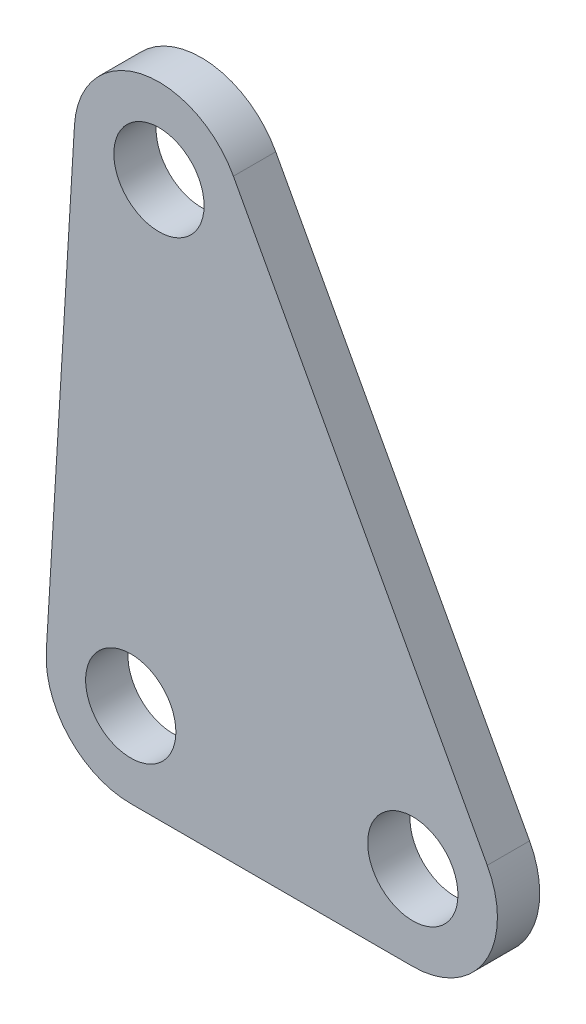
ISO-10303-21;
HEADER;
FILE_DESCRIPTION(('STEP AP214'),'2;1');
FILE_NAME('part.step','',(''),(''),'','','');
FILE_SCHEMA(('AUTOMOTIVE_DESIGN { 1 0 10303 214 1 1 1 1 }'));
ENDSEC;
DATA;
#1=APPLICATION_CONTEXT('core data for automotive mechanical design processes');
#2=APPLICATION_PROTOCOL_DEFINITION('international standard','automotive_design',2000,#1);
#3=PRODUCT_CONTEXT('',#1,'mechanical');
#4=PRODUCT('Part','Part','',(#3));
#5=PRODUCT_RELATED_PRODUCT_CATEGORY('part','',(#4));
#6=PRODUCT_DEFINITION_FORMATION('','',#4);
#7=PRODUCT_DEFINITION_CONTEXT('part definition',#1,'design');
#8=PRODUCT_DEFINITION('design','',#6,#7);
#9=PRODUCT_DEFINITION_SHAPE('','',#8);
#10=(LENGTH_UNIT() NAMED_UNIT(*) SI_UNIT(.MILLI.,.METRE.));
#11=(NAMED_UNIT(*) PLANE_ANGLE_UNIT() SI_UNIT($,.RADIAN.));
#12=(NAMED_UNIT(*) SI_UNIT($,.STERADIAN.) SOLID_ANGLE_UNIT());
#13=UNCERTAINTY_MEASURE_WITH_UNIT(LENGTH_MEASURE(1.E-05),#10,'distance_accuracy_value','');
#14=(GEOMETRIC_REPRESENTATION_CONTEXT(3) GLOBAL_UNCERTAINTY_ASSIGNED_CONTEXT((#13)) GLOBAL_UNIT_ASSIGNED_CONTEXT((#10,
#11,#12)) REPRESENTATION_CONTEXT('',''));
#15=CARTESIAN_POINT('',(0.,0.,0.));
#16=DIRECTION('',(0.,0.,1.));
#17=DIRECTION('',(1.,0.,0.));
#18=AXIS2_PLACEMENT_3D('',#15,#16,#17);
#19=CARTESIAN_POINT('',(-1.,-16.6578196635567,1.5));
#20=DIRECTION('',(0.,0.,1.));
#21=DIRECTION('',(1.,0.,0.));
#22=AXIS2_PLACEMENT_3D('',#19,#20,#21);
#23=PLANE('',#22);
#24=CARTESIAN_POINT('',(9.,-16.6578196635567,1.5));
#25=DIRECTION('',(0.,0.,1.));
#26=DIRECTION('',(1.,0.,0.));
#27=AXIS2_PLACEMENT_3D('',#24,#25,#26);
#28=CIRCLE('',#27,1.6);
#29=CARTESIAN_POINT('',(10.6,-16.6578196635567,1.5));
#30=VERTEX_POINT('',#29);
#31=EDGE_CURVE('E184',#30,#30,#28,.T.);
#32=ORIENTED_EDGE('',*,*,#31,.F.);
#33=EDGE_LOOP('',(#32));
#34=FACE_BOUND('',#33,.T.);
#35=CARTESIAN_POINT('',(-1.,-16.6578196635567,1.5));
#36=DIRECTION('',(0.,0.,1.));
#37=DIRECTION('',(1.,0.,0.));
#38=AXIS2_PLACEMENT_3D('',#35,#36,#37);
#39=CIRCLE('',#38,3.);
#40=CARTESIAN_POINT('',(-3.99460882983099,-16.4780477071834,1.5));
#41=VERTEX_POINT('',#40);
#42=CARTESIAN_POINT('',(-1.,-19.6578196635567,1.5));
#43=VERTEX_POINT('',#42);
#44=EDGE_CURVE('E129',#41,#43,#39,.T.);
#45=ORIENTED_EDGE('',*,*,#44,.T.);
#46=DIRECTION('',(1.,0.,0.));
#47=VECTOR('',#46,1.);
#48=CARTESIAN_POINT('',(-1.,-19.6578196635567,1.5));
#49=LINE('',#48,#47);
#50=CARTESIAN_POINT('',(9.,-19.6578196635567,1.5));
#51=VERTEX_POINT('',#50);
#52=EDGE_CURVE('E87',#43,#51,#49,.T.);
#53=ORIENTED_EDGE('',*,*,#52,.T.);
#54=CARTESIAN_POINT('',(9.,-16.6578196635567,1.5));
#55=DIRECTION('',(0.,0.,1.));
#56=DIRECTION('',(1.,0.,0.));
#57=AXIS2_PLACEMENT_3D('',#54,#55,#56);
#58=CIRCLE('',#57,3.);
#59=CARTESIAN_POINT('',(11.6393996505413,-15.2317868852789,1.5));
#60=VERTEX_POINT('',#59);
#61=EDGE_CURVE('E100',#51,#60,#58,.T.);
#62=ORIENTED_EDGE('',*,*,#61,.T.);
#63=DIRECTION('',(-0.475344259425918,0.87979988351376,0.));
#64=VECTOR('',#63,1.);
#65=CARTESIAN_POINT('',(2.63939965054128,1.42603277827775,1.5));
#66=LINE('',#65,#64);
#67=CARTESIAN_POINT('',(2.63939965054128,1.42603277827775,1.5));
#68=VERTEX_POINT('',#67);
#69=EDGE_CURVE('E94',#60,#68,#66,.T.);
#70=ORIENTED_EDGE('',*,*,#69,.T.);
#71=CARTESIAN_POINT('',(0.,0.,1.5));
#72=DIRECTION('',(0.,0.,1.));
#73=DIRECTION('',(1.,0.,0.));
#74=AXIS2_PLACEMENT_3D('',#71,#72,#73);
#75=CIRCLE('',#74,3.);
#76=CARTESIAN_POINT('',(-2.99460882983099,0.179771956373287,1.5));
#77=VERTEX_POINT('',#76);
#78=EDGE_CURVE('E98',#68,#77,#75,.T.);
#79=ORIENTED_EDGE('',*,*,#78,.T.);
#80=DIRECTION('',(-0.0599239854577622,-0.998202943276996,0.));
#81=VECTOR('',#80,1.);
#82=CARTESIAN_POINT('',(-2.99460882983099,0.179771956373287,1.5));
#83=LINE('',#82,#81);
#84=EDGE_CURVE('E50',#77,#41,#83,.T.);
#85=ORIENTED_EDGE('',*,*,#84,.T.);
#86=EDGE_LOOP('',(#45,#53,#62,#70,#79,#85));
#87=FACE_BOUND('',#86,.T.);
#88=CARTESIAN_POINT('',(0.,0.,1.5));
#89=DIRECTION('',(0.,0.,1.));
#90=DIRECTION('',(1.,0.,0.));
#91=AXIS2_PLACEMENT_3D('',#88,#89,#90);
#92=CIRCLE('',#91,1.6);
#93=CARTESIAN_POINT('',(1.6,0.,1.5));
#94=VERTEX_POINT('',#93);
#95=EDGE_CURVE('E122',#94,#94,#92,.T.);
#96=ORIENTED_EDGE('',*,*,#95,.F.);
#97=EDGE_LOOP('',(#96));
#98=FACE_BOUND('',#97,.T.);
#99=CARTESIAN_POINT('',(-1.,-16.6578196635567,1.5));
#100=DIRECTION('',(0.,0.,1.));
#101=DIRECTION('',(1.,0.,0.));
#102=AXIS2_PLACEMENT_3D('',#99,#100,#101);
#103=CIRCLE('',#102,1.6);
#104=CARTESIAN_POINT('',(0.6,-16.6578196635567,1.5));
#105=VERTEX_POINT('',#104);
#106=EDGE_CURVE('E175',#105,#105,#103,.T.);
#107=ORIENTED_EDGE('',*,*,#106,.F.);
#108=EDGE_LOOP('',(#107));
#109=FACE_BOUND('',#108,.T.);
#110=ADVANCED_FACE('F33',(#34,#87,#98,#109),#23,.T.);
#111=CARTESIAN_POINT('',(-1.,-16.6578196635567,0.));
#112=DIRECTION('',(0.,0.,1.));
#113=DIRECTION('',(1.,0.,0.));
#114=AXIS2_PLACEMENT_3D('',#111,#112,#113);
#115=PLANE('',#114);
#116=CARTESIAN_POINT('',(-1.,-16.6578196635567,0.));
#117=DIRECTION('',(0.,0.,1.));
#118=DIRECTION('',(1.,0.,0.));
#119=AXIS2_PLACEMENT_3D('',#116,#117,#118);
#120=CIRCLE('',#119,3.);
#121=CARTESIAN_POINT('',(-3.99460882983099,-16.4780477071834,0.));
#122=VERTEX_POINT('',#121);
#123=CARTESIAN_POINT('',(-1.,-19.6578196635567,0.));
#124=VERTEX_POINT('',#123);
#125=EDGE_CURVE('E118',#122,#124,#120,.T.);
#126=ORIENTED_EDGE('',*,*,#125,.F.);
#127=DIRECTION('',(-0.0599239854577622,-0.998202943276996,0.));
#128=VECTOR('',#127,1.);
#129=CARTESIAN_POINT('',(-2.99460882983099,0.179771956373287,0.));
#130=LINE('',#129,#128);
#131=CARTESIAN_POINT('',(-2.99460882983099,0.179771956373287,0.));
#132=VERTEX_POINT('',#131);
#133=EDGE_CURVE('E79',#132,#122,#130,.T.);
#134=ORIENTED_EDGE('',*,*,#133,.F.);
#135=CARTESIAN_POINT('',(0.,0.,0.));
#136=DIRECTION('',(0.,0.,1.));
#137=DIRECTION('',(1.,0.,0.));
#138=AXIS2_PLACEMENT_3D('',#135,#136,#137);
#139=CIRCLE('',#138,3.);
#140=CARTESIAN_POINT('',(2.63939965054128,1.42603277827775,0.));
#141=VERTEX_POINT('',#140);
#142=EDGE_CURVE('E73',#141,#132,#139,.T.);
#143=ORIENTED_EDGE('',*,*,#142,.F.);
#144=DIRECTION('',(-0.475344259425918,0.87979988351376,0.));
#145=VECTOR('',#144,1.);
#146=CARTESIAN_POINT('',(2.63939965054128,1.42603277827775,0.));
#147=LINE('',#146,#145);
#148=CARTESIAN_POINT('',(11.6393996505413,-15.2317868852789,0.));
#149=VERTEX_POINT('',#148);
#150=EDGE_CURVE('E108',#149,#141,#147,.T.);
#151=ORIENTED_EDGE('',*,*,#150,.F.);
#152=CARTESIAN_POINT('',(9.,-16.6578196635567,0.));
#153=DIRECTION('',(0.,0.,1.));
#154=DIRECTION('',(1.,0.,0.));
#155=AXIS2_PLACEMENT_3D('',#152,#153,#154);
#156=CIRCLE('',#155,3.);
#157=CARTESIAN_POINT('',(9.,-19.6578196635567,0.));
#158=VERTEX_POINT('',#157);
#159=EDGE_CURVE('E124',#158,#149,#156,.T.);
#160=ORIENTED_EDGE('',*,*,#159,.F.);
#161=DIRECTION('',(1.,0.,0.));
#162=VECTOR('',#161,1.);
#163=CARTESIAN_POINT('',(-1.,-19.6578196635567,0.));
#164=LINE('',#163,#162);
#165=EDGE_CURVE('E121',#124,#158,#164,.T.);
#166=ORIENTED_EDGE('',*,*,#165,.F.);
#167=EDGE_LOOP('',(#126,#134,#143,#151,#160,#166));
#168=FACE_BOUND('',#167,.T.);
#169=CARTESIAN_POINT('',(0.,0.,0.));
#170=DIRECTION('',(0.,0.,1.));
#171=DIRECTION('',(1.,0.,0.));
#172=AXIS2_PLACEMENT_3D('',#169,#170,#171);
#173=CIRCLE('',#172,1.6);
#174=CARTESIAN_POINT('',(1.6,0.,0.));
#175=VERTEX_POINT('',#174);
#176=EDGE_CURVE('E187',#175,#175,#173,.T.);
#177=ORIENTED_EDGE('',*,*,#176,.T.);
#178=EDGE_LOOP('',(#177));
#179=FACE_BOUND('',#178,.T.);
#180=CARTESIAN_POINT('',(9.,-16.6578196635567,0.));
#181=DIRECTION('',(0.,0.,1.));
#182=DIRECTION('',(1.,0.,0.));
#183=AXIS2_PLACEMENT_3D('',#180,#181,#182);
#184=CIRCLE('',#183,1.6);
#185=CARTESIAN_POINT('',(10.6,-16.6578196635567,0.));
#186=VERTEX_POINT('',#185);
#187=EDGE_CURVE('E181',#186,#186,#184,.T.);
#188=ORIENTED_EDGE('',*,*,#187,.T.);
#189=EDGE_LOOP('',(#188));
#190=FACE_BOUND('',#189,.T.);
#191=CARTESIAN_POINT('',(-1.,-16.6578196635567,0.));
#192=DIRECTION('',(0.,0.,1.));
#193=DIRECTION('',(1.,0.,0.));
#194=AXIS2_PLACEMENT_3D('',#191,#192,#193);
#195=CIRCLE('',#194,1.6);
#196=CARTESIAN_POINT('',(0.6,-16.6578196635567,0.));
#197=VERTEX_POINT('',#196);
#198=EDGE_CURVE('E178',#197,#197,#195,.T.);
#199=ORIENTED_EDGE('',*,*,#198,.T.);
#200=EDGE_LOOP('',(#199));
#201=FACE_BOUND('',#200,.T.);
#202=ADVANCED_FACE('F138',(#168,#179,#190,#201),#115,.F.);
#203=CARTESIAN_POINT('',(-1.,-16.6578196635567,1.5));
#204=DIRECTION('',(0.,0.,-1.));
#205=DIRECTION('',(-1.,0.,0.));
#206=AXIS2_PLACEMENT_3D('',#203,#204,#205);
#207=CYLINDRICAL_SURFACE('',#206,3.);
#208=ORIENTED_EDGE('',*,*,#125,.T.);
#209=DIRECTION('',(0.,0.,-1.));
#210=VECTOR('',#209,1.);
#211=CARTESIAN_POINT('',(-1.,-19.6578196635567,1.5));
#212=LINE('',#211,#210);
#213=EDGE_CURVE('E11',#43,#124,#212,.T.);
#214=ORIENTED_EDGE('',*,*,#213,.F.);
#215=ORIENTED_EDGE('',*,*,#44,.F.);
#216=DIRECTION('',(0.,0.,-1.));
#217=VECTOR('',#216,1.);
#218=CARTESIAN_POINT('',(-3.99460882983099,-16.4780477071834,1.5));
#219=LINE('',#218,#217);
#220=EDGE_CURVE('E114',#41,#122,#219,.T.);
#221=ORIENTED_EDGE('',*,*,#220,.T.);
#222=EDGE_LOOP('',(#208,#214,#215,#221));
#223=FACE_BOUND('',#222,.T.);
#224=ADVANCED_FACE('F35',(#223),#207,.T.);
#225=CARTESIAN_POINT('',(-1.,-19.6578196635567,1.5));
#226=DIRECTION('',(0.,1.,0.));
#227=DIRECTION('',(-1.,0.,0.));
#228=AXIS2_PLACEMENT_3D('',#225,#226,#227);
#229=PLANE('',#228);
#230=ORIENTED_EDGE('',*,*,#165,.T.);
#231=DIRECTION('',(0.,0.,-1.));
#232=VECTOR('',#231,1.);
#233=CARTESIAN_POINT('',(9.,-19.6578196635567,1.5));
#234=LINE('',#233,#232);
#235=EDGE_CURVE('E42',#51,#158,#234,.T.);
#236=ORIENTED_EDGE('',*,*,#235,.F.);
#237=ORIENTED_EDGE('',*,*,#52,.F.);
#238=ORIENTED_EDGE('',*,*,#213,.T.);
#239=EDGE_LOOP('',(#230,#236,#237,#238));
#240=FACE_BOUND('',#239,.T.);
#241=ADVANCED_FACE('F237',(#240),#229,.F.);
#242=CARTESIAN_POINT('',(9.,-16.6578196635567,1.5));
#243=DIRECTION('',(0.,0.,-1.));
#244=DIRECTION('',(-1.,0.,0.));
#245=AXIS2_PLACEMENT_3D('',#242,#243,#244);
#246=CYLINDRICAL_SURFACE('',#245,3.);
#247=ORIENTED_EDGE('',*,*,#159,.T.);
#248=DIRECTION('',(0.,0.,-1.));
#249=VECTOR('',#248,1.);
#250=CARTESIAN_POINT('',(11.6393996505413,-15.2317868852789,1.5));
#251=LINE('',#250,#249);
#252=EDGE_CURVE('E109',#60,#149,#251,.T.);
#253=ORIENTED_EDGE('',*,*,#252,.F.);
#254=ORIENTED_EDGE('',*,*,#61,.F.);
#255=ORIENTED_EDGE('',*,*,#235,.T.);
#256=EDGE_LOOP('',(#247,#253,#254,#255));
#257=FACE_BOUND('',#256,.T.);
#258=ADVANCED_FACE('F135',(#257),#246,.T.);
#259=CARTESIAN_POINT('',(2.63939965054128,1.42603277827775,1.5));
#260=DIRECTION('',(-0.87979988351376,-0.475344259425918,0.));
#261=DIRECTION('',(0.475344259425918,-0.87979988351376,0.));
#262=AXIS2_PLACEMENT_3D('',#259,#260,#261);
#263=PLANE('',#262);
#264=ORIENTED_EDGE('',*,*,#150,.T.);
#265=DIRECTION('',(0.,0.,-1.));
#266=VECTOR('',#265,1.);
#267=CARTESIAN_POINT('',(2.63939965054128,1.42603277827775,1.5));
#268=LINE('',#267,#266);
#269=EDGE_CURVE('E105',#68,#141,#268,.T.);
#270=ORIENTED_EDGE('',*,*,#269,.F.);
#271=ORIENTED_EDGE('',*,*,#69,.F.);
#272=ORIENTED_EDGE('',*,*,#252,.T.);
#273=EDGE_LOOP('',(#264,#270,#271,#272));
#274=FACE_BOUND('',#273,.T.);
#275=ADVANCED_FACE('F106',(#274),#263,.F.);
#276=CARTESIAN_POINT('',(0.,0.,1.5));
#277=DIRECTION('',(0.,0.,-1.));
#278=DIRECTION('',(-1.,0.,0.));
#279=AXIS2_PLACEMENT_3D('',#276,#277,#278);
#280=CYLINDRICAL_SURFACE('',#279,3.);
#281=ORIENTED_EDGE('',*,*,#142,.T.);
#282=DIRECTION('',(0.,0.,-1.));
#283=VECTOR('',#282,1.);
#284=CARTESIAN_POINT('',(-2.99460882983099,0.179771956373287,1.5));
#285=LINE('',#284,#283);
#286=EDGE_CURVE('E110',#77,#132,#285,.T.);
#287=ORIENTED_EDGE('',*,*,#286,.F.);
#288=ORIENTED_EDGE('',*,*,#78,.F.);
#289=ORIENTED_EDGE('',*,*,#269,.T.);
#290=EDGE_LOOP('',(#281,#287,#288,#289));
#291=FACE_BOUND('',#290,.T.);
#292=ADVANCED_FACE('F112',(#291),#280,.T.);
#293=CARTESIAN_POINT('',(-2.99460882983099,0.179771956373287,1.5));
#294=DIRECTION('',(0.998202943276996,-0.0599239854577622,0.));
#295=DIRECTION('',(0.0599239854577622,0.998202943276996,0.));
#296=AXIS2_PLACEMENT_3D('',#293,#294,#295);
#297=PLANE('',#296);
#298=ORIENTED_EDGE('',*,*,#133,.T.);
#299=ORIENTED_EDGE('',*,*,#220,.F.);
#300=ORIENTED_EDGE('',*,*,#84,.F.);
#301=ORIENTED_EDGE('',*,*,#286,.T.);
#302=EDGE_LOOP('',(#298,#299,#300,#301));
#303=FACE_BOUND('',#302,.T.);
#304=ADVANCED_FACE('F143',(#303),#297,.F.);
#305=CARTESIAN_POINT('',(0.,0.,1.5));
#306=DIRECTION('',(0.,0.,-1.));
#307=DIRECTION('',(-1.,0.,0.));
#308=AXIS2_PLACEMENT_3D('',#305,#306,#307);
#309=CYLINDRICAL_SURFACE('',#308,1.6);
#310=ORIENTED_EDGE('',*,*,#95,.T.);
#311=EDGE_LOOP('',(#310));
#312=FACE_BOUND('',#311,.T.);
#313=ORIENTED_EDGE('',*,*,#176,.F.);
#314=EDGE_LOOP('',(#313));
#315=FACE_BOUND('',#314,.T.);
#316=ADVANCED_FACE('F145',(#312,#315),#309,.F.);
#317=CARTESIAN_POINT('',(9.,-16.6578196635567,1.5));
#318=DIRECTION('',(0.,0.,-1.));
#319=DIRECTION('',(-1.,0.,0.));
#320=AXIS2_PLACEMENT_3D('',#317,#318,#319);
#321=CYLINDRICAL_SURFACE('',#320,1.6);
#322=ORIENTED_EDGE('',*,*,#31,.T.);
#323=EDGE_LOOP('',(#322));
#324=FACE_BOUND('',#323,.T.);
#325=ORIENTED_EDGE('',*,*,#187,.F.);
#326=EDGE_LOOP('',(#325));
#327=FACE_BOUND('',#326,.T.);
#328=ADVANCED_FACE('F151',(#324,#327),#321,.F.);
#329=CARTESIAN_POINT('',(-1.,-16.6578196635567,1.5));
#330=DIRECTION('',(0.,0.,-1.));
#331=DIRECTION('',(-1.,0.,0.));
#332=AXIS2_PLACEMENT_3D('',#329,#330,#331);
#333=CYLINDRICAL_SURFACE('',#332,1.6);
#334=ORIENTED_EDGE('',*,*,#106,.T.);
#335=EDGE_LOOP('',(#334));
#336=FACE_BOUND('',#335,.T.);
#337=ORIENTED_EDGE('',*,*,#198,.F.);
#338=EDGE_LOOP('',(#337));
#339=FACE_BOUND('',#338,.T.);
#340=ADVANCED_FACE('F166',(#336,#339),#333,.F.);
#341=CLOSED_SHELL('',(#110,#202,#224,#241,#258,#275,#292,#304,#316,#328,#340));
#342=MANIFOLD_SOLID_BREP('B2',#341);
#343=ADVANCED_BREP_SHAPE_REPRESENTATION('',(#18,#342),#14);
#344=SHAPE_DEFINITION_REPRESENTATION(#9,#343);
ENDSEC;
END-ISO-10303-21;
